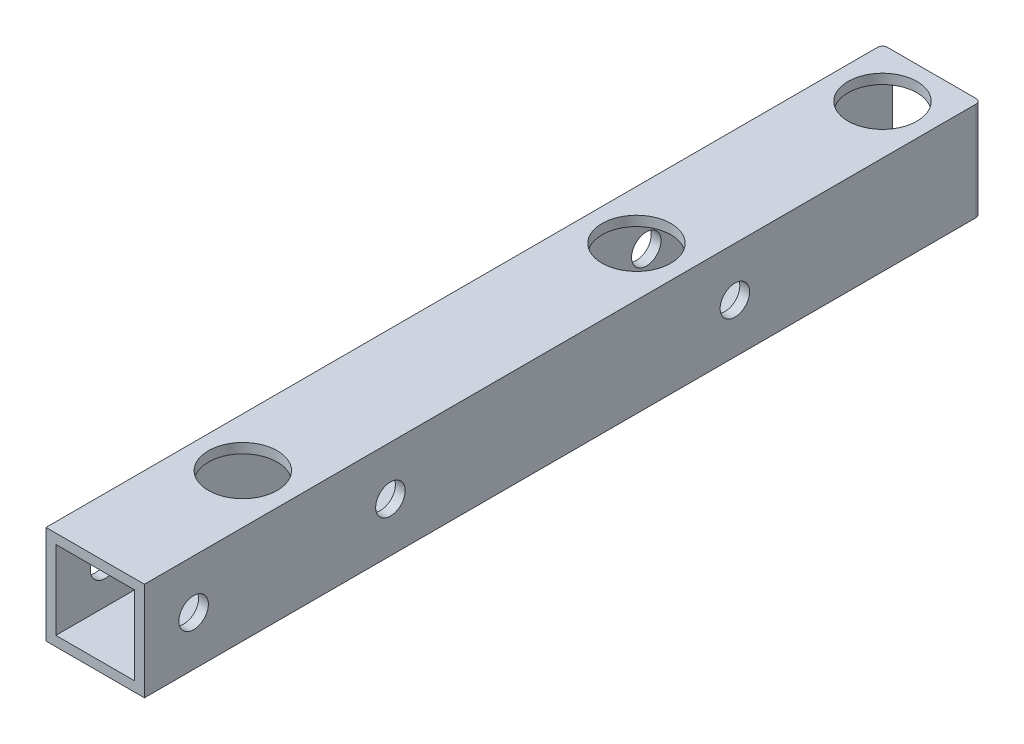
ISO-10303-21;
HEADER;
FILE_DESCRIPTION(('STEP AP214'),'2;1');
FILE_NAME('part.step','',(''),(''),'','','');
FILE_SCHEMA(('AUTOMOTIVE_DESIGN { 1 0 10303 214 1 1 1 1 }'));
ENDSEC;
DATA;
#1=APPLICATION_CONTEXT('core data for automotive mechanical design processes');
#2=APPLICATION_PROTOCOL_DEFINITION('international standard','automotive_design',2000,#1);
#3=PRODUCT_CONTEXT('',#1,'mechanical');
#4=PRODUCT('Part','Part','',(#3));
#5=PRODUCT_RELATED_PRODUCT_CATEGORY('part','',(#4));
#6=PRODUCT_DEFINITION_FORMATION('','',#4);
#7=PRODUCT_DEFINITION_CONTEXT('part definition',#1,'design');
#8=PRODUCT_DEFINITION('design','',#6,#7);
#9=PRODUCT_DEFINITION_SHAPE('','',#8);
#10=(LENGTH_UNIT() NAMED_UNIT(*) SI_UNIT(.MILLI.,.METRE.));
#11=(NAMED_UNIT(*) PLANE_ANGLE_UNIT() SI_UNIT($,.RADIAN.));
#12=(NAMED_UNIT(*) SI_UNIT($,.STERADIAN.) SOLID_ANGLE_UNIT());
#13=UNCERTAINTY_MEASURE_WITH_UNIT(LENGTH_MEASURE(1.E-05),#10,'distance_accuracy_value','');
#14=(GEOMETRIC_REPRESENTATION_CONTEXT(3) GLOBAL_UNCERTAINTY_ASSIGNED_CONTEXT((#13)) GLOBAL_UNIT_ASSIGNED_CONTEXT((#10,
#11,#12)) REPRESENTATION_CONTEXT('',''));
#15=CARTESIAN_POINT('',(0.,0.,0.));
#16=DIRECTION('',(0.,0.,1.));
#17=DIRECTION('',(1.,0.,0.));
#18=AXIS2_PLACEMENT_3D('',#15,#16,#17);
#19=CARTESIAN_POINT('',(0.,0.,85.));
#20=DIRECTION('',(0.,0.,1.));
#21=DIRECTION('',(1.,0.,0.));
#22=AXIS2_PLACEMENT_3D('',#19,#20,#21);
#23=PLANE('',#22);
#24=DIRECTION('',(0.,-1.,0.));
#25=VECTOR('',#24,1.);
#26=CARTESIAN_POINT('',(-5.,5.,85.));
#27=LINE('',#26,#25);
#28=CARTESIAN_POINT('',(-5.,5.,85.));
#29=VERTEX_POINT('',#28);
#30=CARTESIAN_POINT('',(-5.,-5.,85.));
#31=VERTEX_POINT('',#30);
#32=EDGE_CURVE('E186',#29,#31,#27,.T.);
#33=ORIENTED_EDGE('',*,*,#32,.T.);
#34=DIRECTION('',(1.,0.,0.));
#35=VECTOR('',#34,1.);
#36=CARTESIAN_POINT('',(-5.,-5.,85.));
#37=LINE('',#36,#35);
#38=CARTESIAN_POINT('',(5.,-5.,85.));
#39=VERTEX_POINT('',#38);
#40=EDGE_CURVE('E189',#31,#39,#37,.T.);
#41=ORIENTED_EDGE('',*,*,#40,.T.);
#42=DIRECTION('',(0.,1.,0.));
#43=VECTOR('',#42,1.);
#44=CARTESIAN_POINT('',(5.,5.,85.));
#45=LINE('',#44,#43);
#46=CARTESIAN_POINT('',(5.,5.,85.));
#47=VERTEX_POINT('',#46);
#48=EDGE_CURVE('E192',#39,#47,#45,.T.);
#49=ORIENTED_EDGE('',*,*,#48,.T.);
#50=DIRECTION('',(-1.,0.,0.));
#51=VECTOR('',#50,1.);
#52=CARTESIAN_POINT('',(-5.,5.,85.));
#53=LINE('',#52,#51);
#54=EDGE_CURVE('E194',#47,#29,#53,.T.);
#55=ORIENTED_EDGE('',*,*,#54,.T.);
#56=EDGE_LOOP('',(#33,#41,#49,#55));
#57=FACE_BOUND('',#56,.T.);
#58=DIRECTION('',(1.,0.,0.));
#59=VECTOR('',#58,1.);
#60=CARTESIAN_POINT('',(-5.,-4.,85.));
#61=LINE('',#60,#59);
#62=CARTESIAN_POINT('',(-4.,-4.,85.));
#63=VERTEX_POINT('',#62);
#64=CARTESIAN_POINT('',(4.,-4.,85.));
#65=VERTEX_POINT('',#64);
#66=EDGE_CURVE('E153',#63,#65,#61,.T.);
#67=ORIENTED_EDGE('',*,*,#66,.F.);
#68=DIRECTION('',(0.,-1.,0.));
#69=VECTOR('',#68,1.);
#70=CARTESIAN_POINT('',(-4.,5.,85.));
#71=LINE('',#70,#69);
#72=CARTESIAN_POINT('',(-4.,4.,85.));
#73=VERTEX_POINT('',#72);
#74=EDGE_CURVE('E143',#73,#63,#71,.T.);
#75=ORIENTED_EDGE('',*,*,#74,.F.);
#76=DIRECTION('',(-1.,0.,0.));
#77=VECTOR('',#76,1.);
#78=CARTESIAN_POINT('',(-5.,4.,85.));
#79=LINE('',#78,#77);
#80=CARTESIAN_POINT('',(4.,4.,85.));
#81=VERTEX_POINT('',#80);
#82=EDGE_CURVE('E168',#81,#73,#79,.T.);
#83=ORIENTED_EDGE('',*,*,#82,.F.);
#84=DIRECTION('',(0.,1.,0.));
#85=VECTOR('',#84,1.);
#86=CARTESIAN_POINT('',(4.,5.,85.));
#87=LINE('',#86,#85);
#88=EDGE_CURVE('E166',#65,#81,#87,.T.);
#89=ORIENTED_EDGE('',*,*,#88,.F.);
#90=EDGE_LOOP('',(#67,#75,#83,#89));
#91=FACE_BOUND('',#90,.T.);
#92=ADVANCED_FACE('F63',(#57,#91),#23,.T.);
#93=CARTESIAN_POINT('',(0.,0.,0.));
#94=DIRECTION('',(0.,0.,1.));
#95=DIRECTION('',(1.,0.,0.));
#96=AXIS2_PLACEMENT_3D('',#93,#94,#95);
#97=PLANE('',#96);
#98=DIRECTION('',(1.,0.,0.));
#99=VECTOR('',#98,1.);
#100=CARTESIAN_POINT('',(-5.,-5.,0.));
#101=LINE('',#100,#99);
#102=CARTESIAN_POINT('',(-4.5,-5.,0.));
#103=VERTEX_POINT('',#102);
#104=CARTESIAN_POINT('',(4.5,-5.,0.));
#105=VERTEX_POINT('',#104);
#106=EDGE_CURVE('E161',#103,#105,#101,.T.);
#107=ORIENTED_EDGE('',*,*,#106,.F.);
#108=DIRECTION('',(0.,-1.,0.));
#109=VECTOR('',#108,1.);
#110=CARTESIAN_POINT('',(-4.5,0.,0.));
#111=LINE('',#110,#109);
#112=CARTESIAN_POINT('',(-4.5,5.,0.));
#113=VERTEX_POINT('',#112);
#114=EDGE_CURVE('E85',#103,#113,#111,.F.);
#115=ORIENTED_EDGE('',*,*,#114,.T.);
#116=DIRECTION('',(-1.,0.,0.));
#117=VECTOR('',#116,1.);
#118=CARTESIAN_POINT('',(-5.,5.,0.));
#119=LINE('',#118,#117);
#120=CARTESIAN_POINT('',(4.5,5.,0.));
#121=VERTEX_POINT('',#120);
#122=EDGE_CURVE('E190',#121,#113,#119,.T.);
#123=ORIENTED_EDGE('',*,*,#122,.F.);
#124=DIRECTION('',(0.,1.,0.));
#125=VECTOR('',#124,1.);
#126=CARTESIAN_POINT('',(4.5,0.,0.));
#127=LINE('',#126,#125);
#128=EDGE_CURVE('E242',#121,#105,#127,.F.);
#129=ORIENTED_EDGE('',*,*,#128,.T.);
#130=EDGE_LOOP('',(#107,#115,#123,#129));
#131=FACE_BOUND('',#130,.T.);
#132=DIRECTION('',(0.,-1.,0.));
#133=VECTOR('',#132,1.);
#134=CARTESIAN_POINT('',(-4.,5.,0.));
#135=LINE('',#134,#133);
#136=CARTESIAN_POINT('',(-4.,4.,0.));
#137=VERTEX_POINT('',#136);
#138=CARTESIAN_POINT('',(-4.,-4.,0.));
#139=VERTEX_POINT('',#138);
#140=EDGE_CURVE('E173',#137,#139,#135,.T.);
#141=ORIENTED_EDGE('',*,*,#140,.T.);
#142=DIRECTION('',(1.,0.,0.));
#143=VECTOR('',#142,1.);
#144=CARTESIAN_POINT('',(-5.,-4.,0.));
#145=LINE('',#144,#143);
#146=CARTESIAN_POINT('',(4.,-4.,0.));
#147=VERTEX_POINT('',#146);
#148=EDGE_CURVE('E160',#139,#147,#145,.T.);
#149=ORIENTED_EDGE('',*,*,#148,.T.);
#150=DIRECTION('',(0.,1.,0.));
#151=VECTOR('',#150,1.);
#152=CARTESIAN_POINT('',(4.,5.,0.));
#153=LINE('',#152,#151);
#154=CARTESIAN_POINT('',(4.,4.,0.));
#155=VERTEX_POINT('',#154);
#156=EDGE_CURVE('E177',#147,#155,#153,.T.);
#157=ORIENTED_EDGE('',*,*,#156,.T.);
#158=DIRECTION('',(-1.,0.,0.));
#159=VECTOR('',#158,1.);
#160=CARTESIAN_POINT('',(-5.,4.,0.));
#161=LINE('',#160,#159);
#162=EDGE_CURVE('E154',#155,#137,#161,.T.);
#163=ORIENTED_EDGE('',*,*,#162,.T.);
#164=EDGE_LOOP('',(#141,#149,#157,#163));
#165=FACE_BOUND('',#164,.T.);
#166=ADVANCED_FACE('F260',(#131,#165),#97,.F.);
#167=CARTESIAN_POINT('',(-5.,5.,85.));
#168=DIRECTION('',(1.,0.,0.));
#169=DIRECTION('',(0.,1.,0.));
#170=AXIS2_PLACEMENT_3D('',#167,#168,#169);
#171=PLANE('',#170);
#172=CARTESIAN_POINT('',(-5.,0.,25.));
#173=DIRECTION('',(-1.,0.,0.));
#174=DIRECTION('',(0.,-1.,0.));
#175=AXIS2_PLACEMENT_3D('',#172,#173,#174);
#176=CIRCLE('',#175,1.5);
#177=CARTESIAN_POINT('',(-5.,-1.5,25.));
#178=VERTEX_POINT('',#177);
#179=EDGE_CURVE('E397',#178,#178,#176,.T.);
#180=ORIENTED_EDGE('',*,*,#179,.F.);
#181=EDGE_LOOP('',(#180));
#182=FACE_BOUND('',#181,.T.);
#183=CARTESIAN_POINT('',(-5.,0.,60.));
#184=DIRECTION('',(-1.,0.,0.));
#185=DIRECTION('',(0.,-1.,0.));
#186=AXIS2_PLACEMENT_3D('',#183,#184,#185);
#187=CIRCLE('',#186,1.5);
#188=CARTESIAN_POINT('',(-5.,-1.5,60.));
#189=VERTEX_POINT('',#188);
#190=EDGE_CURVE('E394',#189,#189,#187,.T.);
#191=ORIENTED_EDGE('',*,*,#190,.F.);
#192=EDGE_LOOP('',(#191));
#193=FACE_BOUND('',#192,.T.);
#194=CARTESIAN_POINT('',(-5.,0.,80.));
#195=DIRECTION('',(-1.,0.,0.));
#196=DIRECTION('',(0.,-1.,0.));
#197=AXIS2_PLACEMENT_3D('',#194,#195,#196);
#198=CIRCLE('',#197,1.5);
#199=CARTESIAN_POINT('',(-5.,-1.5,80.));
#200=VERTEX_POINT('',#199);
#201=EDGE_CURVE('E388',#200,#200,#198,.T.);
#202=ORIENTED_EDGE('',*,*,#201,.F.);
#203=EDGE_LOOP('',(#202));
#204=FACE_BOUND('',#203,.T.);
#205=DIRECTION('',(0.,0.,-1.));
#206=VECTOR('',#205,1.);
#207=CARTESIAN_POINT('',(-5.,5.,85.));
#208=LINE('',#207,#206);
#209=CARTESIAN_POINT('',(-5.,5.,0.5));
#210=VERTEX_POINT('',#209);
#211=EDGE_CURVE('E196',#29,#210,#208,.T.);
#212=ORIENTED_EDGE('',*,*,#211,.T.);
#213=DIRECTION('',(0.,-1.,0.));
#214=VECTOR('',#213,1.);
#215=CARTESIAN_POINT('',(-5.,5.,0.5));
#216=LINE('',#215,#214);
#217=CARTESIAN_POINT('',(-5.,-5.,0.5));
#218=VERTEX_POINT('',#217);
#219=EDGE_CURVE('E211',#210,#218,#216,.T.);
#220=ORIENTED_EDGE('',*,*,#219,.T.);
#221=DIRECTION('',(0.,0.,-1.));
#222=VECTOR('',#221,1.);
#223=CARTESIAN_POINT('',(-5.,-5.,85.));
#224=LINE('',#223,#222);
#225=EDGE_CURVE('E208',#31,#218,#224,.T.);
#226=ORIENTED_EDGE('',*,*,#225,.F.);
#227=ORIENTED_EDGE('',*,*,#32,.F.);
#228=EDGE_LOOP('',(#212,#220,#226,#227));
#229=FACE_BOUND('',#228,.T.);
#230=ADVANCED_FACE('F254',(#182,#193,#204,#229),#171,.F.);
#231=CARTESIAN_POINT('',(-5.,-5.,85.));
#232=DIRECTION('',(0.,1.,0.));
#233=DIRECTION('',(0.,0.,1.));
#234=AXIS2_PLACEMENT_3D('',#231,#232,#233);
#235=PLANE('',#234);
#236=CARTESIAN_POINT('',(0.,-5.,70.));
#237=DIRECTION('',(0.,1.,0.));
#238=DIRECTION('',(0.,0.,1.));
#239=AXIS2_PLACEMENT_3D('',#236,#237,#238);
#240=CIRCLE('',#239,1.5);
#241=CARTESIAN_POINT('',(0.,-5.,71.5));
#242=VERTEX_POINT('',#241);
#243=EDGE_CURVE('E359',#242,#242,#240,.T.);
#244=ORIENTED_EDGE('',*,*,#243,.T.);
#245=EDGE_LOOP('',(#244));
#246=FACE_BOUND('',#245,.T.);
#247=CARTESIAN_POINT('',(0.,-5.,5.));
#248=DIRECTION('',(0.,1.,0.));
#249=DIRECTION('',(0.,0.,1.));
#250=AXIS2_PLACEMENT_3D('',#247,#248,#249);
#251=CIRCLE('',#250,1.5);
#252=CARTESIAN_POINT('',(0.,-5.,6.50000000000001));
#253=VERTEX_POINT('',#252);
#254=EDGE_CURVE('E363',#253,#253,#251,.T.);
#255=ORIENTED_EDGE('',*,*,#254,.T.);
#256=EDGE_LOOP('',(#255));
#257=FACE_BOUND('',#256,.T.);
#258=CARTESIAN_POINT('',(0.,-5.,30.));
#259=DIRECTION('',(0.,1.,0.));
#260=DIRECTION('',(0.,0.,1.));
#261=AXIS2_PLACEMENT_3D('',#258,#259,#260);
#262=CIRCLE('',#261,1.5);
#263=CARTESIAN_POINT('',(0.,-5.,31.5));
#264=VERTEX_POINT('',#263);
#265=EDGE_CURVE('E366',#264,#264,#262,.T.);
#266=ORIENTED_EDGE('',*,*,#265,.T.);
#267=EDGE_LOOP('',(#266));
#268=FACE_BOUND('',#267,.T.);
#269=ORIENTED_EDGE('',*,*,#225,.T.);
#270=CARTESIAN_POINT('',(-4.5,-5.,0.5));
#271=DIRECTION('',(0.,1.,0.));
#272=DIRECTION('',(0.,0.,1.));
#273=AXIS2_PLACEMENT_3D('',#270,#271,#272);
#274=CIRCLE('',#273,0.5);
#275=EDGE_CURVE('E240',#218,#103,#274,.F.);
#276=ORIENTED_EDGE('',*,*,#275,.T.);
#277=ORIENTED_EDGE('',*,*,#106,.T.);
#278=CARTESIAN_POINT('',(4.5,-5.,0.5));
#279=DIRECTION('',(0.,1.,0.));
#280=DIRECTION('',(0.,0.,1.));
#281=AXIS2_PLACEMENT_3D('',#278,#279,#280);
#282=CIRCLE('',#281,0.5);
#283=CARTESIAN_POINT('',(5.,-5.,0.5));
#284=VERTEX_POINT('',#283);
#285=EDGE_CURVE('E238',#105,#284,#282,.F.);
#286=ORIENTED_EDGE('',*,*,#285,.T.);
#287=DIRECTION('',(0.,0.,-1.));
#288=VECTOR('',#287,1.);
#289=CARTESIAN_POINT('',(5.,-5.,85.));
#290=LINE('',#289,#288);
#291=EDGE_CURVE('E205',#39,#284,#290,.T.);
#292=ORIENTED_EDGE('',*,*,#291,.F.);
#293=ORIENTED_EDGE('',*,*,#40,.F.);
#294=EDGE_LOOP('',(#269,#276,#277,#286,#292,#293));
#295=FACE_BOUND('',#294,.T.);
#296=ADVANCED_FACE('F258',(#246,#257,#268,#295),#235,.F.);
#297=CARTESIAN_POINT('',(5.,5.,85.));
#298=DIRECTION('',(-1.,0.,0.));
#299=DIRECTION('',(0.,0.,1.));
#300=AXIS2_PLACEMENT_3D('',#297,#298,#299);
#301=PLANE('',#300);
#302=CARTESIAN_POINT('',(5.,0.,25.));
#303=DIRECTION('',(-1.,0.,0.));
#304=DIRECTION('',(0.,-1.,0.));
#305=AXIS2_PLACEMENT_3D('',#302,#303,#304);
#306=CIRCLE('',#305,1.5);
#307=CARTESIAN_POINT('',(5.,-1.50000000000001,25.));
#308=VERTEX_POINT('',#307);
#309=EDGE_CURVE('E216',#308,#308,#306,.T.);
#310=ORIENTED_EDGE('',*,*,#309,.T.);
#311=EDGE_LOOP('',(#310));
#312=FACE_BOUND('',#311,.T.);
#313=CARTESIAN_POINT('',(5.,0.,60.));
#314=DIRECTION('',(-1.,0.,0.));
#315=DIRECTION('',(0.,-1.,0.));
#316=AXIS2_PLACEMENT_3D('',#313,#314,#315);
#317=CIRCLE('',#316,1.5);
#318=CARTESIAN_POINT('',(5.,-1.50000000000001,60.));
#319=VERTEX_POINT('',#318);
#320=EDGE_CURVE('E391',#319,#319,#317,.T.);
#321=ORIENTED_EDGE('',*,*,#320,.T.);
#322=EDGE_LOOP('',(#321));
#323=FACE_BOUND('',#322,.T.);
#324=CARTESIAN_POINT('',(5.,0.,80.));
#325=DIRECTION('',(-1.,0.,0.));
#326=DIRECTION('',(0.,-1.,0.));
#327=AXIS2_PLACEMENT_3D('',#324,#325,#326);
#328=CIRCLE('',#327,1.5);
#329=CARTESIAN_POINT('',(5.,-1.5,80.));
#330=VERTEX_POINT('',#329);
#331=EDGE_CURVE('E235',#330,#330,#328,.T.);
#332=ORIENTED_EDGE('',*,*,#331,.T.);
#333=EDGE_LOOP('',(#332));
#334=FACE_BOUND('',#333,.T.);
#335=ORIENTED_EDGE('',*,*,#291,.T.);
#336=DIRECTION('',(0.,1.,0.));
#337=VECTOR('',#336,1.);
#338=CARTESIAN_POINT('',(5.,5.,0.5));
#339=LINE('',#338,#337);
#340=CARTESIAN_POINT('',(5.,5.,0.5));
#341=VERTEX_POINT('',#340);
#342=EDGE_CURVE('E12',#284,#341,#339,.T.);
#343=ORIENTED_EDGE('',*,*,#342,.T.);
#344=DIRECTION('',(0.,0.,-1.));
#345=VECTOR('',#344,1.);
#346=CARTESIAN_POINT('',(5.,5.,85.));
#347=LINE('',#346,#345);
#348=EDGE_CURVE('E202',#47,#341,#347,.T.);
#349=ORIENTED_EDGE('',*,*,#348,.F.);
#350=ORIENTED_EDGE('',*,*,#48,.F.);
#351=EDGE_LOOP('',(#335,#343,#349,#350));
#352=FACE_BOUND('',#351,.T.);
#353=ADVANCED_FACE('F265',(#312,#323,#334,#352),#301,.F.);
#354=CARTESIAN_POINT('',(-5.,5.,85.));
#355=DIRECTION('',(0.,-1.,0.));
#356=DIRECTION('',(0.,0.,-1.));
#357=AXIS2_PLACEMENT_3D('',#354,#355,#356);
#358=PLANE('',#357);
#359=CARTESIAN_POINT('',(0.,5.,5.));
#360=DIRECTION('',(0.,1.,0.));
#361=DIRECTION('',(0.,0.,1.));
#362=AXIS2_PLACEMENT_3D('',#359,#360,#361);
#363=CIRCLE('',#362,3.5);
#364=CARTESIAN_POINT('',(0.,5.,8.5));
#365=VERTEX_POINT('',#364);
#366=EDGE_CURVE('E229',#365,#365,#363,.T.);
#367=ORIENTED_EDGE('',*,*,#366,.F.);
#368=EDGE_LOOP('',(#367));
#369=FACE_BOUND('',#368,.T.);
#370=CARTESIAN_POINT('',(0.,5.,30.));
#371=DIRECTION('',(0.,1.,0.));
#372=DIRECTION('',(0.,0.,1.));
#373=AXIS2_PLACEMENT_3D('',#370,#371,#372);
#374=CIRCLE('',#373,3.5);
#375=CARTESIAN_POINT('',(0.,5.,33.5));
#376=VERTEX_POINT('',#375);
#377=EDGE_CURVE('E405',#376,#376,#374,.T.);
#378=ORIENTED_EDGE('',*,*,#377,.F.);
#379=EDGE_LOOP('',(#378));
#380=FACE_BOUND('',#379,.T.);
#381=CARTESIAN_POINT('',(0.,5.,70.));
#382=DIRECTION('',(0.,1.,0.));
#383=DIRECTION('',(0.,0.,1.));
#384=AXIS2_PLACEMENT_3D('',#381,#382,#383);
#385=CIRCLE('',#384,3.5);
#386=CARTESIAN_POINT('',(0.,5.,73.5));
#387=VERTEX_POINT('',#386);
#388=EDGE_CURVE('E402',#387,#387,#385,.T.);
#389=ORIENTED_EDGE('',*,*,#388,.F.);
#390=EDGE_LOOP('',(#389));
#391=FACE_BOUND('',#390,.T.);
#392=ORIENTED_EDGE('',*,*,#122,.T.);
#393=CARTESIAN_POINT('',(-4.5,5.,0.5));
#394=DIRECTION('',(0.,-1.,0.));
#395=DIRECTION('',(0.,0.,-1.));
#396=AXIS2_PLACEMENT_3D('',#393,#394,#395);
#397=CIRCLE('',#396,0.5);
#398=EDGE_CURVE('E71',#113,#210,#397,.F.);
#399=ORIENTED_EDGE('',*,*,#398,.T.);
#400=ORIENTED_EDGE('',*,*,#211,.F.);
#401=ORIENTED_EDGE('',*,*,#54,.F.);
#402=ORIENTED_EDGE('',*,*,#348,.T.);
#403=CARTESIAN_POINT('',(4.5,5.,0.5));
#404=DIRECTION('',(0.,-1.,0.));
#405=DIRECTION('',(0.,0.,-1.));
#406=AXIS2_PLACEMENT_3D('',#403,#404,#405);
#407=CIRCLE('',#406,0.5);
#408=EDGE_CURVE('E78',#341,#121,#407,.F.);
#409=ORIENTED_EDGE('',*,*,#408,.T.);
#410=EDGE_LOOP('',(#392,#399,#400,#401,#402,#409));
#411=FACE_BOUND('',#410,.T.);
#412=ADVANCED_FACE('F248',(#369,#380,#391,#411),#358,.F.);
#413=CARTESIAN_POINT('',(-4.,5.,85.));
#414=DIRECTION('',(1.,0.,0.));
#415=DIRECTION('',(0.,1.,0.));
#416=AXIS2_PLACEMENT_3D('',#413,#414,#415);
#417=PLANE('',#416);
#418=CARTESIAN_POINT('',(-4.,0.,25.));
#419=DIRECTION('',(1.,0.,0.));
#420=DIRECTION('',(0.,1.,0.));
#421=AXIS2_PLACEMENT_3D('',#418,#419,#420);
#422=CIRCLE('',#421,1.5);
#423=CARTESIAN_POINT('',(-4.,1.50000000000001,25.));
#424=VERTEX_POINT('',#423);
#425=EDGE_CURVE('E224',#424,#424,#422,.T.);
#426=ORIENTED_EDGE('',*,*,#425,.F.);
#427=EDGE_LOOP('',(#426));
#428=FACE_BOUND('',#427,.T.);
#429=CARTESIAN_POINT('',(-4.,0.,60.));
#430=DIRECTION('',(1.,0.,0.));
#431=DIRECTION('',(0.,1.,0.));
#432=AXIS2_PLACEMENT_3D('',#429,#430,#431);
#433=CIRCLE('',#432,1.5);
#434=CARTESIAN_POINT('',(-4.,1.50000000000001,60.));
#435=VERTEX_POINT('',#434);
#436=EDGE_CURVE('E220',#435,#435,#433,.T.);
#437=ORIENTED_EDGE('',*,*,#436,.F.);
#438=EDGE_LOOP('',(#437));
#439=FACE_BOUND('',#438,.T.);
#440=CARTESIAN_POINT('',(-4.,0.,80.));
#441=DIRECTION('',(1.,0.,0.));
#442=DIRECTION('',(0.,1.,0.));
#443=AXIS2_PLACEMENT_3D('',#440,#441,#442);
#444=CIRCLE('',#443,1.5);
#445=CARTESIAN_POINT('',(-4.,1.5,80.));
#446=VERTEX_POINT('',#445);
#447=EDGE_CURVE('E215',#446,#446,#444,.T.);
#448=ORIENTED_EDGE('',*,*,#447,.F.);
#449=EDGE_LOOP('',(#448));
#450=FACE_BOUND('',#449,.T.);
#451=ORIENTED_EDGE('',*,*,#140,.F.);
#452=DIRECTION('',(0.,0.,-1.));
#453=VECTOR('',#452,1.);
#454=CARTESIAN_POINT('',(-4.,4.,85.));
#455=LINE('',#454,#453);
#456=EDGE_CURVE('E149',#73,#137,#455,.T.);
#457=ORIENTED_EDGE('',*,*,#456,.F.);
#458=ORIENTED_EDGE('',*,*,#74,.T.);
#459=DIRECTION('',(0.,0.,-1.));
#460=VECTOR('',#459,1.);
#461=CARTESIAN_POINT('',(-4.,-4.,85.));
#462=LINE('',#461,#460);
#463=EDGE_CURVE('E146',#63,#139,#462,.T.);
#464=ORIENTED_EDGE('',*,*,#463,.T.);
#465=EDGE_LOOP('',(#451,#457,#458,#464));
#466=FACE_BOUND('',#465,.T.);
#467=ADVANCED_FACE('F145',(#428,#439,#450,#466),#417,.T.);
#468=CARTESIAN_POINT('',(-5.,-4.,85.));
#469=DIRECTION('',(0.,1.,0.));
#470=DIRECTION('',(0.,0.,1.));
#471=AXIS2_PLACEMENT_3D('',#468,#469,#470);
#472=PLANE('',#471);
#473=CARTESIAN_POINT('',(0.,-4.,70.));
#474=DIRECTION('',(0.,1.,0.));
#475=DIRECTION('',(0.,0.,1.));
#476=AXIS2_PLACEMENT_3D('',#473,#474,#475);
#477=CIRCLE('',#476,1.5);
#478=CARTESIAN_POINT('',(0.,-4.,71.5));
#479=VERTEX_POINT('',#478);
#480=EDGE_CURVE('E175',#479,#479,#477,.T.);
#481=ORIENTED_EDGE('',*,*,#480,.F.);
#482=EDGE_LOOP('',(#481));
#483=FACE_BOUND('',#482,.T.);
#484=CARTESIAN_POINT('',(0.,-4.,5.));
#485=DIRECTION('',(0.,1.,0.));
#486=DIRECTION('',(0.,0.,1.));
#487=AXIS2_PLACEMENT_3D('',#484,#485,#486);
#488=CIRCLE('',#487,1.5);
#489=CARTESIAN_POINT('',(0.,-4.,6.50000000000001));
#490=VERTEX_POINT('',#489);
#491=EDGE_CURVE('E355',#490,#490,#488,.T.);
#492=ORIENTED_EDGE('',*,*,#491,.F.);
#493=EDGE_LOOP('',(#492));
#494=FACE_BOUND('',#493,.T.);
#495=CARTESIAN_POINT('',(0.,-4.,30.));
#496=DIRECTION('',(0.,1.,0.));
#497=DIRECTION('',(0.,0.,1.));
#498=AXIS2_PLACEMENT_3D('',#495,#496,#497);
#499=CIRCLE('',#498,1.5);
#500=CARTESIAN_POINT('',(0.,-4.,31.5));
#501=VERTEX_POINT('',#500);
#502=EDGE_CURVE('E358',#501,#501,#499,.T.);
#503=ORIENTED_EDGE('',*,*,#502,.F.);
#504=EDGE_LOOP('',(#503));
#505=FACE_BOUND('',#504,.T.);
#506=ORIENTED_EDGE('',*,*,#148,.F.);
#507=ORIENTED_EDGE('',*,*,#463,.F.);
#508=ORIENTED_EDGE('',*,*,#66,.T.);
#509=DIRECTION('',(0.,0.,-1.));
#510=VECTOR('',#509,1.);
#511=CARTESIAN_POINT('',(4.,-4.,85.));
#512=LINE('',#511,#510);
#513=EDGE_CURVE('E162',#65,#147,#512,.T.);
#514=ORIENTED_EDGE('',*,*,#513,.T.);
#515=EDGE_LOOP('',(#506,#507,#508,#514));
#516=FACE_BOUND('',#515,.T.);
#517=ADVANCED_FACE('F157',(#483,#494,#505,#516),#472,.T.);
#518=CARTESIAN_POINT('',(4.,5.,85.));
#519=DIRECTION('',(-1.,0.,0.));
#520=DIRECTION('',(0.,0.,1.));
#521=AXIS2_PLACEMENT_3D('',#518,#519,#520);
#522=PLANE('',#521);
#523=CARTESIAN_POINT('',(4.,0.,25.));
#524=DIRECTION('',(-1.,0.,0.));
#525=DIRECTION('',(0.,0.,1.));
#526=AXIS2_PLACEMENT_3D('',#523,#524,#525);
#527=CIRCLE('',#526,1.5);
#528=CARTESIAN_POINT('',(4.,0.,26.5));
#529=VERTEX_POINT('',#528);
#530=EDGE_CURVE('E221',#529,#529,#527,.T.);
#531=ORIENTED_EDGE('',*,*,#530,.F.);
#532=EDGE_LOOP('',(#531));
#533=FACE_BOUND('',#532,.T.);
#534=CARTESIAN_POINT('',(4.,0.,60.));
#535=DIRECTION('',(-1.,0.,0.));
#536=DIRECTION('',(0.,0.,1.));
#537=AXIS2_PLACEMENT_3D('',#534,#535,#536);
#538=CIRCLE('',#537,1.5);
#539=CARTESIAN_POINT('',(4.,0.,61.5));
#540=VERTEX_POINT('',#539);
#541=EDGE_CURVE('E217',#540,#540,#538,.T.);
#542=ORIENTED_EDGE('',*,*,#541,.F.);
#543=EDGE_LOOP('',(#542));
#544=FACE_BOUND('',#543,.T.);
#545=CARTESIAN_POINT('',(4.,0.,80.));
#546=DIRECTION('',(-1.,0.,0.));
#547=DIRECTION('',(0.,0.,1.));
#548=AXIS2_PLACEMENT_3D('',#545,#546,#547);
#549=CIRCLE('',#548,1.5);
#550=CARTESIAN_POINT('',(4.,0.,81.5));
#551=VERTEX_POINT('',#550);
#552=EDGE_CURVE('E212',#551,#551,#549,.T.);
#553=ORIENTED_EDGE('',*,*,#552,.F.);
#554=EDGE_LOOP('',(#553));
#555=FACE_BOUND('',#554,.T.);
#556=ORIENTED_EDGE('',*,*,#156,.F.);
#557=ORIENTED_EDGE('',*,*,#513,.F.);
#558=ORIENTED_EDGE('',*,*,#88,.T.);
#559=DIRECTION('',(0.,0.,-1.));
#560=VECTOR('',#559,1.);
#561=CARTESIAN_POINT('',(4.,4.,85.));
#562=LINE('',#561,#560);
#563=EDGE_CURVE('E183',#81,#155,#562,.T.);
#564=ORIENTED_EDGE('',*,*,#563,.T.);
#565=EDGE_LOOP('',(#556,#557,#558,#564));
#566=FACE_BOUND('',#565,.T.);
#567=ADVANCED_FACE('F339',(#533,#544,#555,#566),#522,.T.);
#568=CARTESIAN_POINT('',(-5.,4.,85.));
#569=DIRECTION('',(0.,-1.,0.));
#570=DIRECTION('',(0.,0.,-1.));
#571=AXIS2_PLACEMENT_3D('',#568,#569,#570);
#572=PLANE('',#571);
#573=CARTESIAN_POINT('',(0.,4.,5.));
#574=DIRECTION('',(0.,-1.,0.));
#575=DIRECTION('',(0.,0.,-1.));
#576=AXIS2_PLACEMENT_3D('',#573,#574,#575);
#577=CIRCLE('',#576,3.5);
#578=CARTESIAN_POINT('',(0.,4.,1.50000000000001));
#579=VERTEX_POINT('',#578);
#580=EDGE_CURVE('E232',#579,#579,#577,.T.);
#581=ORIENTED_EDGE('',*,*,#580,.F.);
#582=EDGE_LOOP('',(#581));
#583=FACE_BOUND('',#582,.T.);
#584=CARTESIAN_POINT('',(0.,4.,30.));
#585=DIRECTION('',(0.,-1.,0.));
#586=DIRECTION('',(0.,0.,-1.));
#587=AXIS2_PLACEMENT_3D('',#584,#585,#586);
#588=CIRCLE('',#587,3.5);
#589=CARTESIAN_POINT('',(0.,4.,26.5));
#590=VERTEX_POINT('',#589);
#591=EDGE_CURVE('E228',#590,#590,#588,.T.);
#592=ORIENTED_EDGE('',*,*,#591,.F.);
#593=EDGE_LOOP('',(#592));
#594=FACE_BOUND('',#593,.T.);
#595=CARTESIAN_POINT('',(0.,4.,70.));
#596=DIRECTION('',(0.,-1.,0.));
#597=DIRECTION('',(0.,0.,-1.));
#598=AXIS2_PLACEMENT_3D('',#595,#596,#597);
#599=CIRCLE('',#598,3.5);
#600=CARTESIAN_POINT('',(0.,4.,66.5));
#601=VERTEX_POINT('',#600);
#602=EDGE_CURVE('E225',#601,#601,#599,.T.);
#603=ORIENTED_EDGE('',*,*,#602,.F.);
#604=EDGE_LOOP('',(#603));
#605=FACE_BOUND('',#604,.T.);
#606=ORIENTED_EDGE('',*,*,#162,.F.);
#607=ORIENTED_EDGE('',*,*,#563,.F.);
#608=ORIENTED_EDGE('',*,*,#82,.T.);
#609=ORIENTED_EDGE('',*,*,#456,.T.);
#610=EDGE_LOOP('',(#606,#607,#608,#609));
#611=FACE_BOUND('',#610,.T.);
#612=ADVANCED_FACE('F335',(#583,#594,#605,#611),#572,.T.);
#613=CARTESIAN_POINT('',(0.,-5.,30.));
#614=DIRECTION('',(0.,1.,0.));
#615=DIRECTION('',(0.,0.,1.));
#616=AXIS2_PLACEMENT_3D('',#613,#614,#615);
#617=CYLINDRICAL_SURFACE('',#616,1.5);
#618=ORIENTED_EDGE('',*,*,#502,.T.);
#619=EDGE_LOOP('',(#618));
#620=FACE_BOUND('',#619,.T.);
#621=ORIENTED_EDGE('',*,*,#265,.F.);
#622=EDGE_LOOP('',(#621));
#623=FACE_BOUND('',#622,.T.);
#624=ADVANCED_FACE('F331',(#620,#623),#617,.F.);
#625=CARTESIAN_POINT('',(0.,-5.,5.));
#626=DIRECTION('',(0.,1.,0.));
#627=DIRECTION('',(0.,0.,1.));
#628=AXIS2_PLACEMENT_3D('',#625,#626,#627);
#629=CYLINDRICAL_SURFACE('',#628,1.5);
#630=ORIENTED_EDGE('',*,*,#491,.T.);
#631=EDGE_LOOP('',(#630));
#632=FACE_BOUND('',#631,.T.);
#633=ORIENTED_EDGE('',*,*,#254,.F.);
#634=EDGE_LOOP('',(#633));
#635=FACE_BOUND('',#634,.T.);
#636=ADVANCED_FACE('F327',(#632,#635),#629,.F.);
#637=CARTESIAN_POINT('',(0.,-5.,70.));
#638=DIRECTION('',(0.,1.,0.));
#639=DIRECTION('',(0.,0.,1.));
#640=AXIS2_PLACEMENT_3D('',#637,#638,#639);
#641=CYLINDRICAL_SURFACE('',#640,1.5);
#642=ORIENTED_EDGE('',*,*,#480,.T.);
#643=EDGE_LOOP('',(#642));
#644=FACE_BOUND('',#643,.T.);
#645=ORIENTED_EDGE('',*,*,#243,.F.);
#646=EDGE_LOOP('',(#645));
#647=FACE_BOUND('',#646,.T.);
#648=ADVANCED_FACE('F323',(#644,#647),#641,.F.);
#649=CARTESIAN_POINT('',(5.,0.,80.));
#650=DIRECTION('',(-1.,0.,0.));
#651=DIRECTION('',(0.,-1.,0.));
#652=AXIS2_PLACEMENT_3D('',#649,#650,#651);
#653=CYLINDRICAL_SURFACE('',#652,1.5);
#654=ORIENTED_EDGE('',*,*,#552,.T.);
#655=EDGE_LOOP('',(#654));
#656=FACE_BOUND('',#655,.T.);
#657=ORIENTED_EDGE('',*,*,#331,.F.);
#658=EDGE_LOOP('',(#657));
#659=FACE_BOUND('',#658,.T.);
#660=ADVANCED_FACE('F318',(#656,#659),#653,.F.);
#661=CARTESIAN_POINT('',(5.,0.,60.));
#662=DIRECTION('',(-1.,0.,0.));
#663=DIRECTION('',(0.,-1.,0.));
#664=AXIS2_PLACEMENT_3D('',#661,#662,#663);
#665=CYLINDRICAL_SURFACE('',#664,1.5);
#666=ORIENTED_EDGE('',*,*,#541,.T.);
#667=EDGE_LOOP('',(#666));
#668=FACE_BOUND('',#667,.T.);
#669=ORIENTED_EDGE('',*,*,#320,.F.);
#670=EDGE_LOOP('',(#669));
#671=FACE_BOUND('',#670,.T.);
#672=ADVANCED_FACE('F314',(#668,#671),#665,.F.);
#673=CARTESIAN_POINT('',(5.,0.,25.));
#674=DIRECTION('',(-1.,0.,0.));
#675=DIRECTION('',(0.,-1.,0.));
#676=AXIS2_PLACEMENT_3D('',#673,#674,#675);
#677=CYLINDRICAL_SURFACE('',#676,1.5);
#678=ORIENTED_EDGE('',*,*,#530,.T.);
#679=EDGE_LOOP('',(#678));
#680=FACE_BOUND('',#679,.T.);
#681=ORIENTED_EDGE('',*,*,#309,.F.);
#682=EDGE_LOOP('',(#681));
#683=FACE_BOUND('',#682,.T.);
#684=ADVANCED_FACE('F310',(#680,#683),#677,.F.);
#685=ORIENTED_EDGE('',*,*,#447,.T.);
#686=EDGE_LOOP('',(#685));
#687=FACE_BOUND('',#686,.T.);
#688=ORIENTED_EDGE('',*,*,#201,.T.);
#689=EDGE_LOOP('',(#688));
#690=FACE_BOUND('',#689,.T.);
#691=ADVANCED_FACE('F313',(#687,#690),#653,.F.);
#692=ORIENTED_EDGE('',*,*,#436,.T.);
#693=EDGE_LOOP('',(#692));
#694=FACE_BOUND('',#693,.T.);
#695=ORIENTED_EDGE('',*,*,#190,.T.);
#696=EDGE_LOOP('',(#695));
#697=FACE_BOUND('',#696,.T.);
#698=ADVANCED_FACE('F320',(#694,#697),#665,.F.);
#699=ORIENTED_EDGE('',*,*,#425,.T.);
#700=EDGE_LOOP('',(#699));
#701=FACE_BOUND('',#700,.T.);
#702=ORIENTED_EDGE('',*,*,#179,.T.);
#703=EDGE_LOOP('',(#702));
#704=FACE_BOUND('',#703,.T.);
#705=ADVANCED_FACE('F308',(#701,#704),#677,.F.);
#706=CARTESIAN_POINT('',(0.,0.,70.));
#707=DIRECTION('',(0.,1.,0.));
#708=DIRECTION('',(0.,0.,1.));
#709=AXIS2_PLACEMENT_3D('',#706,#707,#708);
#710=CYLINDRICAL_SURFACE('',#709,3.5);
#711=ORIENTED_EDGE('',*,*,#602,.T.);
#712=EDGE_LOOP('',(#711));
#713=FACE_BOUND('',#712,.T.);
#714=ORIENTED_EDGE('',*,*,#388,.T.);
#715=EDGE_LOOP('',(#714));
#716=FACE_BOUND('',#715,.T.);
#717=ADVANCED_FACE('F301',(#713,#716),#710,.F.);
#718=CARTESIAN_POINT('',(0.,0.,30.));
#719=DIRECTION('',(0.,1.,0.));
#720=DIRECTION('',(0.,0.,1.));
#721=AXIS2_PLACEMENT_3D('',#718,#719,#720);
#722=CYLINDRICAL_SURFACE('',#721,3.5);
#723=ORIENTED_EDGE('',*,*,#591,.T.);
#724=EDGE_LOOP('',(#723));
#725=FACE_BOUND('',#724,.T.);
#726=ORIENTED_EDGE('',*,*,#377,.T.);
#727=EDGE_LOOP('',(#726));
#728=FACE_BOUND('',#727,.T.);
#729=ADVANCED_FACE('F295',(#725,#728),#722,.F.);
#730=CARTESIAN_POINT('',(0.,0.,5.));
#731=DIRECTION('',(0.,1.,0.));
#732=DIRECTION('',(0.,0.,1.));
#733=AXIS2_PLACEMENT_3D('',#730,#731,#732);
#734=CYLINDRICAL_SURFACE('',#733,3.5);
#735=ORIENTED_EDGE('',*,*,#580,.T.);
#736=EDGE_LOOP('',(#735));
#737=FACE_BOUND('',#736,.T.);
#738=ORIENTED_EDGE('',*,*,#366,.T.);
#739=EDGE_LOOP('',(#738));
#740=FACE_BOUND('',#739,.T.);
#741=ADVANCED_FACE('F290',(#737,#740),#734,.F.);
#742=CARTESIAN_POINT('',(-4.5,5.,0.5));
#743=DIRECTION('',(0.,-1.,0.));
#744=DIRECTION('',(1.,0.,0.));
#745=AXIS2_PLACEMENT_3D('',#742,#743,#744);
#746=CYLINDRICAL_SURFACE('',#745,0.5);
#747=ORIENTED_EDGE('',*,*,#398,.F.);
#748=ORIENTED_EDGE('',*,*,#114,.F.);
#749=ORIENTED_EDGE('',*,*,#275,.F.);
#750=ORIENTED_EDGE('',*,*,#219,.F.);
#751=EDGE_LOOP('',(#747,#748,#749,#750));
#752=FACE_BOUND('',#751,.T.);
#753=ADVANCED_FACE('F256',(#752),#746,.T.);
#754=CARTESIAN_POINT('',(4.5,5.,0.5));
#755=DIRECTION('',(0.,1.,0.));
#756=DIRECTION('',(0.,0.,1.));
#757=AXIS2_PLACEMENT_3D('',#754,#755,#756);
#758=CYLINDRICAL_SURFACE('',#757,0.5);
#759=ORIENTED_EDGE('',*,*,#285,.F.);
#760=ORIENTED_EDGE('',*,*,#128,.F.);
#761=ORIENTED_EDGE('',*,*,#408,.F.);
#762=ORIENTED_EDGE('',*,*,#342,.F.);
#763=EDGE_LOOP('',(#759,#760,#761,#762));
#764=FACE_BOUND('',#763,.T.);
#765=ADVANCED_FACE('F65',(#764),#758,.T.);
#766=CLOSED_SHELL('',(#92,#166,#230,#296,#353,#412,#467,#517,#567,#612,#624,#636,#648,#660,#672,
#684,#691,#698,#705,#717,#729,#741,#753,#765));
#767=MANIFOLD_SOLID_BREP('B2',#766);
#768=ADVANCED_BREP_SHAPE_REPRESENTATION('',(#18,#767),#14);
#769=SHAPE_DEFINITION_REPRESENTATION(#9,#768);
ENDSEC;
END-ISO-10303-21;
